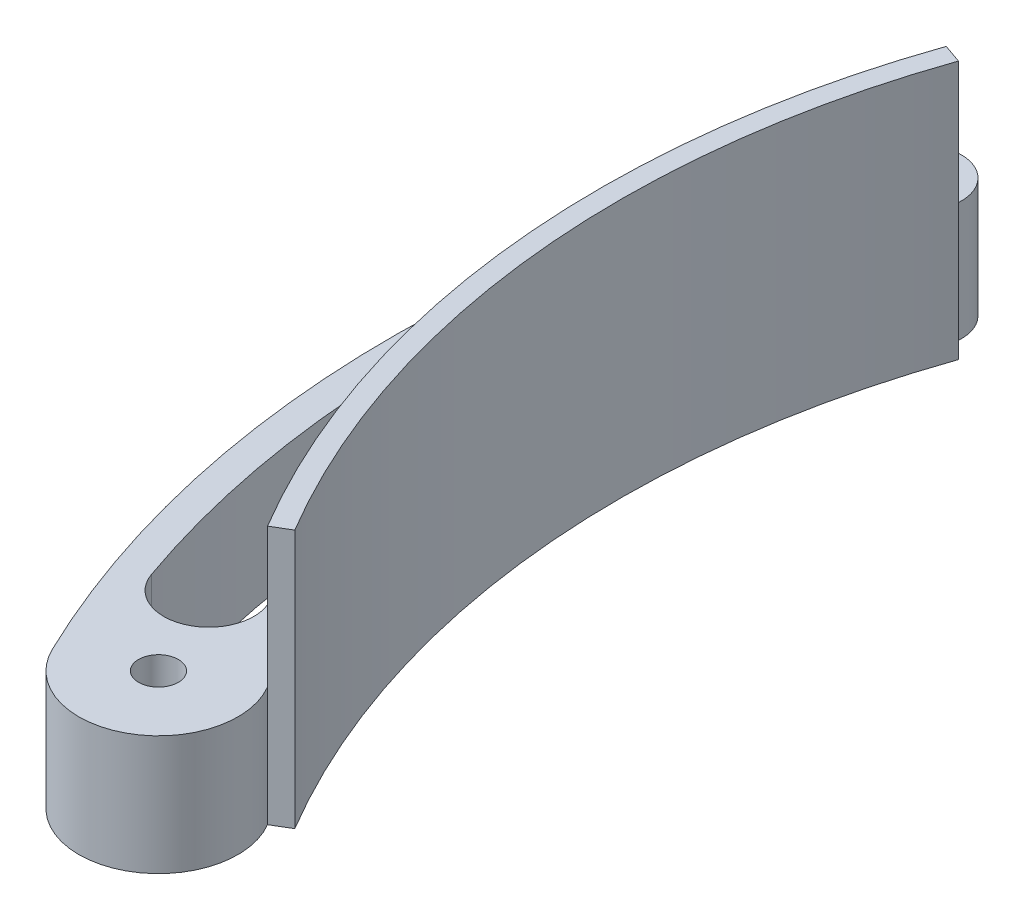
ISO-10303-21;
HEADER;
FILE_DESCRIPTION(('STEP AP214'),'2;1');
FILE_NAME('part.step','',(''),(''),'','','');
FILE_SCHEMA(('AUTOMOTIVE_DESIGN { 1 0 10303 214 1 1 1 1 }'));
ENDSEC;
DATA;
#1=APPLICATION_CONTEXT('core data for automotive mechanical design processes');
#2=APPLICATION_PROTOCOL_DEFINITION('international standard','automotive_design',2000,#1);
#3=PRODUCT_CONTEXT('',#1,'mechanical');
#4=PRODUCT('Part','Part','',(#3));
#5=PRODUCT_RELATED_PRODUCT_CATEGORY('part','',(#4));
#6=PRODUCT_DEFINITION_FORMATION('','',#4);
#7=PRODUCT_DEFINITION_CONTEXT('part definition',#1,'design');
#8=PRODUCT_DEFINITION('design','',#6,#7);
#9=PRODUCT_DEFINITION_SHAPE('','',#8);
#10=(LENGTH_UNIT() NAMED_UNIT(*) SI_UNIT(.MILLI.,.METRE.));
#11=(NAMED_UNIT(*) PLANE_ANGLE_UNIT() SI_UNIT($,.RADIAN.));
#12=(NAMED_UNIT(*) SI_UNIT($,.STERADIAN.) SOLID_ANGLE_UNIT());
#13=UNCERTAINTY_MEASURE_WITH_UNIT(LENGTH_MEASURE(1.E-05),#10,'distance_accuracy_value','');
#14=(GEOMETRIC_REPRESENTATION_CONTEXT(3) GLOBAL_UNCERTAINTY_ASSIGNED_CONTEXT((#13)) GLOBAL_UNIT_ASSIGNED_CONTEXT((#10,
#11,#12)) REPRESENTATION_CONTEXT('',''));
#15=CARTESIAN_POINT('',(0.,0.,0.));
#16=DIRECTION('',(0.,0.,1.));
#17=DIRECTION('',(1.,0.,0.));
#18=AXIS2_PLACEMENT_3D('',#15,#16,#17);
#19=CARTESIAN_POINT('',(0.,41.275,0.));
#20=DIRECTION('',(0.,-1.,0.));
#21=DIRECTION('',(0.,0.,-1.));
#22=AXIS2_PLACEMENT_3D('',#19,#20,#21);
#23=CYLINDRICAL_SURFACE('',#22,143.256);
#24=CARTESIAN_POINT('',(0.,0.,0.));
#25=DIRECTION('',(0.,1.,0.));
#26=DIRECTION('',(0.,0.,-1.));
#27=AXIS2_PLACEMENT_3D('',#24,#25,#26);
#28=CIRCLE('',#27,143.256);
#29=CARTESIAN_POINT('',(-135.252327307706,0.,-47.2132343082858));
#30=VERTEX_POINT('',#29);
#31=CARTESIAN_POINT('',(-123.105955958198,0.,73.2612117263843));
#32=VERTEX_POINT('',#31);
#33=EDGE_CURVE('E106',#30,#32,#28,.T.);
#34=ORIENTED_EDGE('',*,*,#33,.T.);
#35=DIRECTION('',(0.,-1.,0.));
#36=VECTOR('',#35,1.);
#37=CARTESIAN_POINT('',(-123.105955958198,41.275,73.2612117263843));
#38=LINE('',#37,#36);
#39=CARTESIAN_POINT('',(-123.105955958198,41.275,73.2612117263843));
#40=VERTEX_POINT('',#39);
#41=EDGE_CURVE('E12',#40,#32,#38,.T.);
#42=ORIENTED_EDGE('',*,*,#41,.F.);
#43=CARTESIAN_POINT('',(0.,41.275,0.));
#44=DIRECTION('',(0.,1.,0.));
#45=DIRECTION('',(0.,0.,-1.));
#46=AXIS2_PLACEMENT_3D('',#43,#44,#45);
#47=CIRCLE('',#46,143.256);
#48=CARTESIAN_POINT('',(-135.252327307706,41.275,-47.2132343082858));
#49=VERTEX_POINT('',#48);
#50=EDGE_CURVE('E94',#49,#40,#47,.T.);
#51=ORIENTED_EDGE('',*,*,#50,.F.);
#52=DIRECTION('',(0.,-1.,0.));
#53=VECTOR('',#52,1.);
#54=CARTESIAN_POINT('',(-135.252327307706,41.275,-47.2132343082858));
#55=LINE('',#54,#53);
#56=EDGE_CURVE('E102',#49,#30,#55,.T.);
#57=ORIENTED_EDGE('',*,*,#56,.T.);
#58=EDGE_LOOP('',(#34,#42,#51,#57));
#59=FACE_BOUND('',#58,.T.);
#60=ADVANCED_FACE('F43',(#59),#23,.T.);
#61=CARTESIAN_POINT('',(-123.105955958198,41.275,73.2612117263843));
#62=DIRECTION('',(-0.51140065146581,0.,-0.859342407705069));
#63=DIRECTION('',(-0.859342407705069,0.,0.51140065146581));
#64=AXIS2_PLACEMENT_3D('',#61,#62,#63);
#65=PLANE('',#64);
#66=DIRECTION('',(0.859342407705069,0.,-0.51140065146581));
#67=VECTOR('',#66,1.);
#68=CARTESIAN_POINT('',(-123.105955958198,0.,73.2612117263843));
#69=LINE('',#68,#67);
#70=CARTESIAN_POINT('',(-120.377543813735,0.,71.6375146579804));
#71=VERTEX_POINT('',#70);
#72=EDGE_CURVE('E98',#32,#71,#69,.T.);
#73=ORIENTED_EDGE('',*,*,#72,.T.);
#74=DIRECTION('',(0.,-1.,0.));
#75=VECTOR('',#74,1.);
#76=CARTESIAN_POINT('',(-120.377543813735,41.275,71.6375146579804));
#77=LINE('',#76,#75);
#78=CARTESIAN_POINT('',(-120.377543813735,41.275,71.6375146579804));
#79=VERTEX_POINT('',#78);
#80=EDGE_CURVE('E51',#79,#71,#77,.T.);
#81=ORIENTED_EDGE('',*,*,#80,.F.);
#82=DIRECTION('',(0.859342407705069,0.,-0.51140065146581));
#83=VECTOR('',#82,1.);
#84=CARTESIAN_POINT('',(-123.105955958198,41.275,73.2612117263843));
#85=LINE('',#84,#83);
#86=EDGE_CURVE('E89',#40,#79,#85,.T.);
#87=ORIENTED_EDGE('',*,*,#86,.F.);
#88=ORIENTED_EDGE('',*,*,#41,.T.);
#89=EDGE_LOOP('',(#73,#81,#87,#88));
#90=FACE_BOUND('',#89,.T.);
#91=ADVANCED_FACE('F97',(#90),#65,.F.);
#92=CARTESIAN_POINT('',(0.,41.275,0.));
#93=DIRECTION('',(0.,-1.,0.));
#94=DIRECTION('',(0.,0.,-1.));
#95=AXIS2_PLACEMENT_3D('',#92,#93,#94);
#96=CYLINDRICAL_SURFACE('',#95,140.081);
#97=CARTESIAN_POINT('',(0.,0.,0.));
#98=DIRECTION('',(0.,-1.,0.));
#99=DIRECTION('',(0.,0.,-1.));
#100=AXIS2_PLACEMENT_3D('',#97,#98,#99);
#101=CIRCLE('',#100,140.081);
#102=CARTESIAN_POINT('',(-132.254713670567,0.,-46.1668417039354));
#103=VERTEX_POINT('',#102);
#104=EDGE_CURVE('E76',#71,#103,#101,.T.);
#105=ORIENTED_EDGE('',*,*,#104,.T.);
#106=DIRECTION('',(0.,-1.,0.));
#107=VECTOR('',#106,1.);
#108=CARTESIAN_POINT('',(-132.254713670567,41.275,-46.1668417039354));
#109=LINE('',#108,#107);
#110=CARTESIAN_POINT('',(-132.254713670567,41.275,-46.1668417039354));
#111=VERTEX_POINT('',#110);
#112=EDGE_CURVE('E99',#111,#103,#109,.T.);
#113=ORIENTED_EDGE('',*,*,#112,.F.);
#114=CARTESIAN_POINT('',(0.,41.275,0.));
#115=DIRECTION('',(0.,-1.,0.));
#116=DIRECTION('',(0.,0.,-1.));
#117=AXIS2_PLACEMENT_3D('',#114,#115,#116);
#118=CIRCLE('',#117,140.081);
#119=EDGE_CURVE('E92',#79,#111,#118,.T.);
#120=ORIENTED_EDGE('',*,*,#119,.F.);
#121=ORIENTED_EDGE('',*,*,#80,.T.);
#122=EDGE_LOOP('',(#105,#113,#120,#121));
#123=FACE_BOUND('',#122,.T.);
#124=ADVANCED_FACE('F100',(#123),#96,.F.);
#125=CARTESIAN_POINT('',(-132.254713670567,41.275,-46.1668417039355));
#126=DIRECTION('',(-0.329572473811114,0.,0.944130279413823));
#127=DIRECTION('',(0.944130279413823,0.,0.329572473811114));
#128=AXIS2_PLACEMENT_3D('',#125,#126,#127);
#129=PLANE('',#128);
#130=DIRECTION('',(-0.944130279413823,0.,-0.329572473811114));
#131=VECTOR('',#130,1.);
#132=CARTESIAN_POINT('',(-132.254713670567,0.,-46.1668417039355));
#133=LINE('',#132,#131);
#134=EDGE_CURVE('E82',#103,#30,#133,.T.);
#135=ORIENTED_EDGE('',*,*,#134,.T.);
#136=ORIENTED_EDGE('',*,*,#56,.F.);
#137=DIRECTION('',(-0.944130279413823,0.,-0.329572473811114));
#138=VECTOR('',#137,1.);
#139=CARTESIAN_POINT('',(-132.254713670567,41.275,-46.1668417039355));
#140=LINE('',#139,#138);
#141=EDGE_CURVE('E59',#111,#49,#140,.T.);
#142=ORIENTED_EDGE('',*,*,#141,.F.);
#143=ORIENTED_EDGE('',*,*,#112,.T.);
#144=EDGE_LOOP('',(#135,#136,#142,#143));
#145=FACE_BOUND('',#144,.T.);
#146=ADVANCED_FACE('F113',(#145),#129,.F.);
#147=CARTESIAN_POINT('',(0.,41.275,0.));
#148=DIRECTION('',(0.,-1.,0.));
#149=DIRECTION('',(0.,0.,-1.));
#150=AXIS2_PLACEMENT_3D('',#147,#148,#149);
#151=PLANE('',#150);
#152=ORIENTED_EDGE('',*,*,#50,.T.);
#153=ORIENTED_EDGE('',*,*,#86,.T.);
#154=ORIENTED_EDGE('',*,*,#119,.T.);
#155=ORIENTED_EDGE('',*,*,#141,.T.);
#156=EDGE_LOOP('',(#152,#153,#154,#155));
#157=FACE_BOUND('',#156,.T.);
#158=ADVANCED_FACE('F90',(#157),#151,.F.);
#159=CARTESIAN_POINT('',(0.,0.,0.));
#160=DIRECTION('',(0.,-1.,0.));
#161=DIRECTION('',(0.,0.,-1.));
#162=AXIS2_PLACEMENT_3D('',#159,#160,#161);
#163=PLANE('',#162);
#164=ORIENTED_EDGE('',*,*,#33,.F.);
#165=ORIENTED_EDGE('',*,*,#134,.F.);
#166=ORIENTED_EDGE('',*,*,#104,.F.);
#167=ORIENTED_EDGE('',*,*,#72,.F.);
#168=EDGE_LOOP('',(#164,#165,#166,#167));
#169=FACE_BOUND('',#168,.T.);
#170=ADVANCED_FACE('F116',(#169),#163,.T.);
#171=CLOSED_SHELL('',(#60,#91,#124,#146,#158,#170));
#172=MANIFOLD_SOLID_BREP('B2',#171);
#173=CARTESIAN_POINT('',(-70.623777290992,19.05,-24.6530097584931));
#174=DIRECTION('',(0.,-1.,0.));
#175=DIRECTION('',(0.,0.,-1.));
#176=AXIS2_PLACEMENT_3D('',#173,#174,#175);
#177=PLANE('',#176);
#178=CARTESIAN_POINT('',(6.10622663543836E-13,19.05,14.9965934754486));
#179=DIRECTION('',(0.,1.,0.));
#180=DIRECTION('',(0.,0.,1.));
#181=AXIS2_PLACEMENT_3D('',#178,#179,#180);
#182=CIRCLE('',#181,156.783175561678);
#183=CARTESIAN_POINT('',(-156.687530970008,19.05,20.4721553394356));
#184=VERTEX_POINT('',#183);
#185=CARTESIAN_POINT('',(-147.905040723107,19.05,67.0068142777081));
#186=VERTEX_POINT('',#185);
#187=EDGE_CURVE('E283',#184,#186,#182,.T.);
#188=ORIENTED_EDGE('',*,*,#187,.F.);
#189=CARTESIAN_POINT('',(-151.678534298402,19.05,20.2971122394384));
#190=DIRECTION('',(0.,1.,0.));
#191=DIRECTION('',(0.,0.,-1.));
#192=AXIS2_PLACEMENT_3D('',#189,#190,#191);
#193=CIRCLE('',#192,5.01205424382321);
#194=CARTESIAN_POINT('',(-146.710761390019,19.05,19.6323415468161));
#195=VERTEX_POINT('',#194);
#196=EDGE_CURVE('E182',#195,#184,#193,.T.);
#197=ORIENTED_EDGE('',*,*,#196,.F.);
#198=CARTESIAN_POINT('',(0.,19.05,0.));
#199=DIRECTION('',(0.,-1.,0.));
#200=DIRECTION('',(0.,0.,1.));
#201=AXIS2_PLACEMENT_3D('',#198,#199,#200);
#202=CIRCLE('',#201,148.0185);
#203=CARTESIAN_POINT('',(-134.579739329338,19.05,61.6260505330135));
#204=VERTEX_POINT('',#203);
#205=EDGE_CURVE('E274',#204,#195,#202,.T.);
#206=ORIENTED_EDGE('',*,*,#205,.F.);
#207=CARTESIAN_POINT('',(-141.119521250419,19.05,64.6207132746109));
#208=DIRECTION('',(0.,1.,0.));
#209=DIRECTION('',(0.,0.,1.));
#210=AXIS2_PLACEMENT_3D('',#207,#208,#209);
#211=CIRCLE('',#210,7.19282646191412);
#212=EDGE_CURVE('E277',#186,#204,#211,.T.);
#213=ORIENTED_EDGE('',*,*,#212,.F.);
#214=EDGE_LOOP('',(#188,#197,#206,#213));
#215=FACE_BOUND('',#214,.T.);
#216=CARTESIAN_POINT('',(-141.247554581984,19.05,-49.3060195169863));
#217=DIRECTION('',(0.,1.,0.));
#218=DIRECTION('',(0.,0.,-1.));
#219=AXIS2_PLACEMENT_3D('',#216,#217,#218);
#220=CIRCLE('',#219,2.38125000000001);
#221=CARTESIAN_POINT('',(-138.99934435413,19.05,-48.5212250637236));
#222=VERTEX_POINT('',#221);
#223=CARTESIAN_POINT('',(-143.414791124697,19.05,-50.2926487940848));
#224=VERTEX_POINT('',#223);
#225=EDGE_CURVE('E308',#222,#224,#220,.T.);
#226=ORIENTED_EDGE('',*,*,#225,.F.);
#227=CARTESIAN_POINT('',(0.,19.05,0.));
#228=DIRECTION('',(0.,-1.,0.));
#229=DIRECTION('',(0.,0.,1.));
#230=AXIS2_PLACEMENT_3D('',#227,#228,#229);
#231=CIRCLE('',#230,147.22475);
#232=CARTESIAN_POINT('',(-147.012407174969,19.05,-7.9043753190894));
#233=VERTEX_POINT('',#232);
#234=EDGE_CURVE('E289',#233,#222,#231,.T.);
#235=ORIENTED_EDGE('',*,*,#234,.F.);
#236=CARTESIAN_POINT('',(-151.412669682045,19.05,-8.1409630127869));
#237=DIRECTION('',(0.,1.,0.));
#238=DIRECTION('',(0.,0.,-1.));
#239=AXIS2_PLACEMENT_3D('',#236,#237,#238);
#240=CIRCLE('',#239,4.40661818949472);
#241=CARTESIAN_POINT('',(-155.768721685777,19.05,-8.80661668307543));
#242=VERTEX_POINT('',#241);
#243=EDGE_CURVE('E297',#242,#233,#240,.T.);
#244=ORIENTED_EDGE('',*,*,#243,.F.);
#245=CARTESIAN_POINT('',(6.10622663543836E-13,19.05,14.9965934754486));
#246=DIRECTION('',(0.,1.,0.));
#247=DIRECTION('',(0.,0.,1.));
#248=AXIS2_PLACEMENT_3D('',#245,#246,#247);
#249=CIRCLE('',#248,157.576925561678);
#250=EDGE_CURVE('E311',#224,#242,#249,.T.);
#251=ORIENTED_EDGE('',*,*,#250,.F.);
#252=EDGE_LOOP('',(#226,#235,#244,#251));
#253=FACE_BOUND('',#252,.T.);
#254=CARTESIAN_POINT('',(-141.247554581984,19.05,-49.3060195169863));
#255=DIRECTION('',(0.,1.,0.));
#256=DIRECTION('',(0.,0.,-1.));
#257=AXIS2_PLACEMENT_3D('',#254,#255,#256);
#258=CIRCLE('',#257,6.34999999999998);
#259=CARTESIAN_POINT('',(-135.252327307706,19.05,-47.2132343082858));
#260=VERTEX_POINT('',#259);
#261=CARTESIAN_POINT('',(-147.02685202922,19.05,-51.9370309225823));
#262=VERTEX_POINT('',#261);
#263=EDGE_CURVE('E337',#260,#262,#258,.T.);
#264=ORIENTED_EDGE('',*,*,#263,.T.);
#265=CARTESIAN_POINT('',(6.10622663543836E-13,19.05,14.9965934754486));
#266=DIRECTION('',(0.,1.,0.));
#267=DIRECTION('',(0.,0.,-1.));
#268=AXIS2_PLACEMENT_3D('',#265,#266,#267);
#269=CIRCLE('',#268,161.545675561678);
#270=CARTESIAN_POINT('',(-145.454595651415,19.05,85.2814844304899));
#271=VERTEX_POINT('',#270);
#272=EDGE_CURVE('E340',#262,#271,#269,.T.);
#273=ORIENTED_EDGE('',*,*,#272,.T.);
#274=CARTESIAN_POINT('',(-134.019604536053,19.05,79.756));
#275=DIRECTION('',(0.,1.,0.));
#276=DIRECTION('',(0.,0.,-1.));
#277=AXIS2_PLACEMENT_3D('',#274,#275,#276);
#278=CIRCLE('',#277,12.7);
#279=CARTESIAN_POINT('',(-123.105955958198,19.05,73.2612117263844));
#280=VERTEX_POINT('',#279);
#281=EDGE_CURVE('E343',#271,#280,#278,.T.);
#282=ORIENTED_EDGE('',*,*,#281,.T.);
#283=CARTESIAN_POINT('',(0.,19.05,0.));
#284=DIRECTION('',(0.,-1.,0.));
#285=DIRECTION('',(0.,0.,1.));
#286=AXIS2_PLACEMENT_3D('',#283,#284,#285);
#287=CIRCLE('',#286,143.256);
#288=EDGE_CURVE('E345',#280,#260,#287,.T.);
#289=ORIENTED_EDGE('',*,*,#288,.T.);
#290=EDGE_LOOP('',(#264,#273,#282,#289));
#291=FACE_BOUND('',#290,.T.);
#292=CARTESIAN_POINT('',(-134.019604536053,19.05,79.756));
#293=DIRECTION('',(0.,1.,0.));
#294=DIRECTION('',(0.,0.,1.));
#295=AXIS2_PLACEMENT_3D('',#292,#293,#294);
#296=CIRCLE('',#295,3.17499999999997);
#297=CARTESIAN_POINT('',(-134.019604536053,19.05,82.931));
#298=VERTEX_POINT('',#297);
#299=EDGE_CURVE('E331',#298,#298,#296,.T.);
#300=ORIENTED_EDGE('',*,*,#299,.F.);
#301=EDGE_LOOP('',(#300));
#302=FACE_BOUND('',#301,.T.);
#303=CARTESIAN_POINT('',(-152.238831544355,19.05,5.76613740234445));
#304=DIRECTION('',(0.,1.,0.));
#305=DIRECTION('',(0.,0.,1.));
#306=AXIS2_PLACEMENT_3D('',#303,#304,#305);
#307=CIRCLE('',#306,3.175);
#308=CARTESIAN_POINT('',(-152.238831544355,19.05,8.94113740234445));
#309=VERTEX_POINT('',#308);
#310=EDGE_CURVE('E325',#309,#309,#307,.T.);
#311=ORIENTED_EDGE('',*,*,#310,.F.);
#312=EDGE_LOOP('',(#311));
#313=FACE_BOUND('',#312,.T.);
#314=ADVANCED_FACE('F167',(#215,#253,#291,#302,#313),#177,.F.);
#315=CARTESIAN_POINT('',(-70.623777290992,0.,-24.6530097584931));
#316=DIRECTION('',(0.,-1.,0.));
#317=DIRECTION('',(0.,0.,-1.));
#318=AXIS2_PLACEMENT_3D('',#315,#316,#317);
#319=PLANE('',#318);
#320=CARTESIAN_POINT('',(-151.678534298402,0.,20.2971122394384));
#321=DIRECTION('',(0.,1.,0.));
#322=DIRECTION('',(0.,0.,-1.));
#323=AXIS2_PLACEMENT_3D('',#320,#321,#322);
#324=CIRCLE('',#323,5.01205424382321);
#325=CARTESIAN_POINT('',(-146.710761390019,0.,19.6323415468161));
#326=VERTEX_POINT('',#325);
#327=CARTESIAN_POINT('',(-156.687530970008,0.,20.4721553394356));
#328=VERTEX_POINT('',#327);
#329=EDGE_CURVE('E258',#326,#328,#324,.T.);
#330=ORIENTED_EDGE('',*,*,#329,.T.);
#331=CARTESIAN_POINT('',(6.10622663543836E-13,0.,14.9965934754486));
#332=DIRECTION('',(0.,1.,0.));
#333=DIRECTION('',(0.,0.,1.));
#334=AXIS2_PLACEMENT_3D('',#331,#332,#333);
#335=CIRCLE('',#334,156.783175561678);
#336=CARTESIAN_POINT('',(-147.905040723107,0.,67.0068142777081));
#337=VERTEX_POINT('',#336);
#338=EDGE_CURVE('E267',#328,#337,#335,.T.);
#339=ORIENTED_EDGE('',*,*,#338,.T.);
#340=CARTESIAN_POINT('',(-141.119521250419,0.,64.6207132746109));
#341=DIRECTION('',(0.,1.,0.));
#342=DIRECTION('',(0.,0.,1.));
#343=AXIS2_PLACEMENT_3D('',#340,#341,#342);
#344=CIRCLE('',#343,7.19282646191412);
#345=CARTESIAN_POINT('',(-134.579739329338,0.,61.6260505330135));
#346=VERTEX_POINT('',#345);
#347=EDGE_CURVE('E190',#337,#346,#344,.T.);
#348=ORIENTED_EDGE('',*,*,#347,.T.);
#349=CARTESIAN_POINT('',(0.,0.,0.));
#350=DIRECTION('',(0.,-1.,0.));
#351=DIRECTION('',(0.,0.,1.));
#352=AXIS2_PLACEMENT_3D('',#349,#350,#351);
#353=CIRCLE('',#352,148.0185);
#354=EDGE_CURVE('E264',#346,#326,#353,.T.);
#355=ORIENTED_EDGE('',*,*,#354,.T.);
#356=EDGE_LOOP('',(#330,#339,#348,#355));
#357=FACE_BOUND('',#356,.T.);
#358=CARTESIAN_POINT('',(0.,0.,0.));
#359=DIRECTION('',(0.,-1.,0.));
#360=DIRECTION('',(0.,0.,1.));
#361=AXIS2_PLACEMENT_3D('',#358,#359,#360);
#362=CIRCLE('',#361,147.22475);
#363=CARTESIAN_POINT('',(-147.012407174969,0.,-7.9043753190894));
#364=VERTEX_POINT('',#363);
#365=CARTESIAN_POINT('',(-138.99934435413,0.,-48.5212250637236));
#366=VERTEX_POINT('',#365);
#367=EDGE_CURVE('E293',#364,#366,#362,.T.);
#368=ORIENTED_EDGE('',*,*,#367,.T.);
#369=CARTESIAN_POINT('',(-141.247554581984,0.,-49.3060195169863));
#370=DIRECTION('',(0.,1.,0.));
#371=DIRECTION('',(0.,0.,-1.));
#372=AXIS2_PLACEMENT_3D('',#369,#370,#371);
#373=CIRCLE('',#372,2.38125000000001);
#374=CARTESIAN_POINT('',(-143.414791124697,0.,-50.2926487940848));
#375=VERTEX_POINT('',#374);
#376=EDGE_CURVE('E296',#366,#375,#373,.T.);
#377=ORIENTED_EDGE('',*,*,#376,.T.);
#378=CARTESIAN_POINT('',(6.10622663543836E-13,0.,14.9965934754486));
#379=DIRECTION('',(0.,1.,0.));
#380=DIRECTION('',(0.,0.,1.));
#381=AXIS2_PLACEMENT_3D('',#378,#379,#380);
#382=CIRCLE('',#381,157.576925561678);
#383=CARTESIAN_POINT('',(-155.768721685777,0.,-8.80661668307543));
#384=VERTEX_POINT('',#383);
#385=EDGE_CURVE('E300',#375,#384,#382,.T.);
#386=ORIENTED_EDGE('',*,*,#385,.T.);
#387=CARTESIAN_POINT('',(-151.412669682045,0.,-8.1409630127869));
#388=DIRECTION('',(0.,1.,0.));
#389=DIRECTION('',(0.,0.,-1.));
#390=AXIS2_PLACEMENT_3D('',#387,#388,#389);
#391=CIRCLE('',#390,4.40661818949472);
#392=EDGE_CURVE('E303',#384,#364,#391,.T.);
#393=ORIENTED_EDGE('',*,*,#392,.T.);
#394=EDGE_LOOP('',(#368,#377,#386,#393));
#395=FACE_BOUND('',#394,.T.);
#396=CARTESIAN_POINT('',(-134.019604536053,0.,79.756));
#397=DIRECTION('',(0.,1.,0.));
#398=DIRECTION('',(0.,0.,1.));
#399=AXIS2_PLACEMENT_3D('',#396,#397,#398);
#400=CIRCLE('',#399,3.17499999999997);
#401=CARTESIAN_POINT('',(-134.019604536053,0.,82.931));
#402=VERTEX_POINT('',#401);
#403=EDGE_CURVE('E328',#402,#402,#400,.T.);
#404=ORIENTED_EDGE('',*,*,#403,.T.);
#405=EDGE_LOOP('',(#404));
#406=FACE_BOUND('',#405,.T.);
#407=CARTESIAN_POINT('',(-141.247554581984,0.,-49.3060195169863));
#408=DIRECTION('',(0.,1.,0.));
#409=DIRECTION('',(0.,0.,-1.));
#410=AXIS2_PLACEMENT_3D('',#407,#408,#409);
#411=CIRCLE('',#410,6.34999999999998);
#412=CARTESIAN_POINT('',(-135.252327307706,0.,-47.2132343082858));
#413=VERTEX_POINT('',#412);
#414=CARTESIAN_POINT('',(-147.02685202922,0.,-51.9370309225823));
#415=VERTEX_POINT('',#414);
#416=EDGE_CURVE('E334',#413,#415,#411,.T.);
#417=ORIENTED_EDGE('',*,*,#416,.F.);
#418=CARTESIAN_POINT('',(0.,0.,0.));
#419=DIRECTION('',(0.,-1.,0.));
#420=DIRECTION('',(0.,0.,1.));
#421=AXIS2_PLACEMENT_3D('',#418,#419,#420);
#422=CIRCLE('',#421,143.256);
#423=CARTESIAN_POINT('',(-123.105955958198,0.,73.2612117263844));
#424=VERTEX_POINT('',#423);
#425=EDGE_CURVE('E341',#424,#413,#422,.T.);
#426=ORIENTED_EDGE('',*,*,#425,.F.);
#427=CARTESIAN_POINT('',(-134.019604536053,0.,79.756));
#428=DIRECTION('',(0.,1.,0.));
#429=DIRECTION('',(0.,0.,-1.));
#430=AXIS2_PLACEMENT_3D('',#427,#428,#429);
#431=CIRCLE('',#430,12.7);
#432=CARTESIAN_POINT('',(-145.454595651415,0.,85.2814844304899));
#433=VERTEX_POINT('',#432);
#434=EDGE_CURVE('E352',#433,#424,#431,.T.);
#435=ORIENTED_EDGE('',*,*,#434,.F.);
#436=CARTESIAN_POINT('',(6.10622663543836E-13,0.,14.9965934754486));
#437=DIRECTION('',(0.,1.,0.));
#438=DIRECTION('',(0.,0.,-1.));
#439=AXIS2_PLACEMENT_3D('',#436,#437,#438);
#440=CIRCLE('',#439,161.545675561678);
#441=EDGE_CURVE('E350',#415,#433,#440,.T.);
#442=ORIENTED_EDGE('',*,*,#441,.F.);
#443=EDGE_LOOP('',(#417,#426,#435,#442));
#444=FACE_BOUND('',#443,.T.);
#445=CARTESIAN_POINT('',(-152.238831544355,0.,5.76613740234445));
#446=DIRECTION('',(0.,1.,0.));
#447=DIRECTION('',(0.,0.,1.));
#448=AXIS2_PLACEMENT_3D('',#445,#446,#447);
#449=CIRCLE('',#448,3.175);
#450=CARTESIAN_POINT('',(-152.238831544355,0.,8.94113740234445));
#451=VERTEX_POINT('',#450);
#452=EDGE_CURVE('E318',#451,#451,#449,.T.);
#453=ORIENTED_EDGE('',*,*,#452,.T.);
#454=EDGE_LOOP('',(#453));
#455=FACE_BOUND('',#454,.T.);
#456=ADVANCED_FACE('F271',(#357,#395,#406,#444,#455),#319,.T.);
#457=CARTESIAN_POINT('',(-141.247554581984,19.05,-49.3060195169863));
#458=DIRECTION('',(0.,-1.,0.));
#459=DIRECTION('',(0.,0.,-1.));
#460=AXIS2_PLACEMENT_3D('',#457,#458,#459);
#461=CYLINDRICAL_SURFACE('',#460,6.34999999999998);
#462=ORIENTED_EDGE('',*,*,#416,.T.);
#463=DIRECTION('',(0.,-1.,0.));
#464=VECTOR('',#463,1.);
#465=CARTESIAN_POINT('',(-147.02685202922,19.05,-51.9370309225823));
#466=LINE('',#465,#464);
#467=EDGE_CURVE('E41',#262,#415,#466,.T.);
#468=ORIENTED_EDGE('',*,*,#467,.F.);
#469=ORIENTED_EDGE('',*,*,#263,.F.);
#470=DIRECTION('',(0.,-1.,0.));
#471=VECTOR('',#470,1.);
#472=CARTESIAN_POINT('',(-135.252327307706,19.05,-47.2132343082858));
#473=LINE('',#472,#471);
#474=EDGE_CURVE('E347',#260,#413,#473,.T.);
#475=ORIENTED_EDGE('',*,*,#474,.T.);
#476=EDGE_LOOP('',(#462,#468,#469,#475));
#477=FACE_BOUND('',#476,.T.);
#478=ADVANCED_FACE('F169',(#477),#461,.T.);
#479=CARTESIAN_POINT('',(6.10622663543836E-13,19.05,14.9965934754486));
#480=DIRECTION('',(0.,-1.,0.));
#481=DIRECTION('',(0.,0.,-1.));
#482=AXIS2_PLACEMENT_3D('',#479,#480,#481);
#483=CYLINDRICAL_SURFACE('',#482,161.545675561678);
#484=ORIENTED_EDGE('',*,*,#441,.T.);
#485=DIRECTION('',(0.,-1.,0.));
#486=VECTOR('',#485,1.);
#487=CARTESIAN_POINT('',(-145.454595651415,19.05,85.2814844304899));
#488=LINE('',#487,#486);
#489=EDGE_CURVE('E175',#271,#433,#488,.T.);
#490=ORIENTED_EDGE('',*,*,#489,.F.);
#491=ORIENTED_EDGE('',*,*,#272,.F.);
#492=ORIENTED_EDGE('',*,*,#467,.T.);
#493=EDGE_LOOP('',(#484,#490,#491,#492));
#494=FACE_BOUND('',#493,.T.);
#495=ADVANCED_FACE('F380',(#494),#483,.T.);
#496=CARTESIAN_POINT('',(-134.019604536053,19.05,79.756));
#497=DIRECTION('',(0.,-1.,0.));
#498=DIRECTION('',(0.,0.,-1.));
#499=AXIS2_PLACEMENT_3D('',#496,#497,#498);
#500=CYLINDRICAL_SURFACE('',#499,12.7);
#501=ORIENTED_EDGE('',*,*,#434,.T.);
#502=DIRECTION('',(0.,-1.,0.));
#503=VECTOR('',#502,1.);
#504=CARTESIAN_POINT('',(-123.105955958198,19.05,73.2612117263844));
#505=LINE('',#504,#503);
#506=EDGE_CURVE('E357',#280,#424,#505,.T.);
#507=ORIENTED_EDGE('',*,*,#506,.F.);
#508=ORIENTED_EDGE('',*,*,#281,.F.);
#509=ORIENTED_EDGE('',*,*,#489,.T.);
#510=EDGE_LOOP('',(#501,#507,#508,#509));
#511=FACE_BOUND('',#510,.T.);
#512=ADVANCED_FACE('F364',(#511),#500,.T.);
#513=CARTESIAN_POINT('',(0.,19.05,0.));
#514=DIRECTION('',(0.,-1.,0.));
#515=DIRECTION('',(0.,0.,-1.));
#516=AXIS2_PLACEMENT_3D('',#513,#514,#515);
#517=CYLINDRICAL_SURFACE('',#516,143.256);
#518=ORIENTED_EDGE('',*,*,#425,.T.);
#519=ORIENTED_EDGE('',*,*,#474,.F.);
#520=ORIENTED_EDGE('',*,*,#288,.F.);
#521=ORIENTED_EDGE('',*,*,#506,.T.);
#522=EDGE_LOOP('',(#518,#519,#520,#521));
#523=FACE_BOUND('',#522,.T.);
#524=ADVANCED_FACE('F373',(#523),#517,.F.);
#525=CARTESIAN_POINT('',(-134.019604536053,19.05,79.756));
#526=DIRECTION('',(0.,-1.,0.));
#527=DIRECTION('',(0.,0.,-1.));
#528=AXIS2_PLACEMENT_3D('',#525,#526,#527);
#529=CYLINDRICAL_SURFACE('',#528,3.17499999999997);
#530=ORIENTED_EDGE('',*,*,#299,.T.);
#531=EDGE_LOOP('',(#530));
#532=FACE_BOUND('',#531,.T.);
#533=ORIENTED_EDGE('',*,*,#403,.F.);
#534=EDGE_LOOP('',(#533));
#535=FACE_BOUND('',#534,.T.);
#536=ADVANCED_FACE('F396',(#532,#535),#529,.F.);
#537=CARTESIAN_POINT('',(-152.238831544355,19.05,5.76613740234445));
#538=DIRECTION('',(0.,-1.,0.));
#539=DIRECTION('',(0.,0.,-1.));
#540=AXIS2_PLACEMENT_3D('',#537,#538,#539);
#541=CYLINDRICAL_SURFACE('',#540,3.175);
#542=ORIENTED_EDGE('',*,*,#310,.T.);
#543=EDGE_LOOP('',(#542));
#544=FACE_BOUND('',#543,.T.);
#545=ORIENTED_EDGE('',*,*,#452,.F.);
#546=EDGE_LOOP('',(#545));
#547=FACE_BOUND('',#546,.T.);
#548=ADVANCED_FACE('F403',(#544,#547),#541,.F.);
#549=CARTESIAN_POINT('',(0.,0.,0.));
#550=DIRECTION('',(0.,1.,0.));
#551=DIRECTION('',(0.,0.,1.));
#552=AXIS2_PLACEMENT_3D('',#549,#550,#551);
#553=CYLINDRICAL_SURFACE('',#552,147.22475);
#554=ORIENTED_EDGE('',*,*,#234,.T.);
#555=DIRECTION('',(0.,1.,0.));
#556=VECTOR('',#555,1.);
#557=CARTESIAN_POINT('',(-138.99934435413,0.,-48.5212250637236));
#558=LINE('',#557,#556);
#559=EDGE_CURVE('E306',#366,#222,#558,.T.);
#560=ORIENTED_EDGE('',*,*,#559,.F.);
#561=ORIENTED_EDGE('',*,*,#367,.F.);
#562=DIRECTION('',(0.,1.,0.));
#563=VECTOR('',#562,1.);
#564=CARTESIAN_POINT('',(-147.012407174969,0.,-7.9043753190894));
#565=LINE('',#564,#563);
#566=EDGE_CURVE('E316',#364,#233,#565,.T.);
#567=ORIENTED_EDGE('',*,*,#566,.T.);
#568=EDGE_LOOP('',(#554,#560,#561,#567));
#569=FACE_BOUND('',#568,.T.);
#570=ADVANCED_FACE('F408',(#569),#553,.T.);
#571=CARTESIAN_POINT('',(-151.412669682045,0.,-8.1409630127869));
#572=DIRECTION('',(0.,1.,0.));
#573=DIRECTION('',(0.,0.,1.));
#574=AXIS2_PLACEMENT_3D('',#571,#572,#573);
#575=CYLINDRICAL_SURFACE('',#574,4.40661818949472);
#576=ORIENTED_EDGE('',*,*,#243,.T.);
#577=ORIENTED_EDGE('',*,*,#566,.F.);
#578=ORIENTED_EDGE('',*,*,#392,.F.);
#579=DIRECTION('',(0.,1.,0.));
#580=VECTOR('',#579,1.);
#581=CARTESIAN_POINT('',(-155.768721685777,0.,-8.80661668307543));
#582=LINE('',#581,#580);
#583=EDGE_CURVE('E319',#384,#242,#582,.T.);
#584=ORIENTED_EDGE('',*,*,#583,.T.);
#585=EDGE_LOOP('',(#576,#577,#578,#584));
#586=FACE_BOUND('',#585,.T.);
#587=ADVANCED_FACE('F421',(#586),#575,.F.);
#588=CARTESIAN_POINT('',(6.10622663543836E-13,0.,14.9965934754486));
#589=DIRECTION('',(0.,1.,0.));
#590=DIRECTION('',(0.,0.,1.));
#591=AXIS2_PLACEMENT_3D('',#588,#589,#590);
#592=CYLINDRICAL_SURFACE('',#591,157.576925561678);
#593=ORIENTED_EDGE('',*,*,#250,.T.);
#594=ORIENTED_EDGE('',*,*,#583,.F.);
#595=ORIENTED_EDGE('',*,*,#385,.F.);
#596=DIRECTION('',(0.,1.,0.));
#597=VECTOR('',#596,1.);
#598=CARTESIAN_POINT('',(-143.414791124697,0.,-50.2926487940848));
#599=LINE('',#598,#597);
#600=EDGE_CURVE('E321',#375,#224,#599,.T.);
#601=ORIENTED_EDGE('',*,*,#600,.T.);
#602=EDGE_LOOP('',(#593,#594,#595,#601));
#603=FACE_BOUND('',#602,.T.);
#604=ADVANCED_FACE('F428',(#603),#592,.F.);
#605=CARTESIAN_POINT('',(-141.247554581984,0.,-49.3060195169863));
#606=DIRECTION('',(0.,1.,0.));
#607=DIRECTION('',(0.,0.,1.));
#608=AXIS2_PLACEMENT_3D('',#605,#606,#607);
#609=CYLINDRICAL_SURFACE('',#608,2.38125000000001);
#610=ORIENTED_EDGE('',*,*,#225,.T.);
#611=ORIENTED_EDGE('',*,*,#600,.F.);
#612=ORIENTED_EDGE('',*,*,#376,.F.);
#613=ORIENTED_EDGE('',*,*,#559,.T.);
#614=EDGE_LOOP('',(#610,#611,#612,#613));
#615=FACE_BOUND('',#614,.T.);
#616=ADVANCED_FACE('F425',(#615),#609,.F.);
#617=CARTESIAN_POINT('',(-151.678534298402,0.,20.2971122394384));
#618=DIRECTION('',(0.,1.,0.));
#619=DIRECTION('',(0.,0.,1.));
#620=AXIS2_PLACEMENT_3D('',#617,#618,#619);
#621=CYLINDRICAL_SURFACE('',#620,5.01205424382321);
#622=ORIENTED_EDGE('',*,*,#196,.T.);
#623=DIRECTION('',(0.,1.,0.));
#624=VECTOR('',#623,1.);
#625=CARTESIAN_POINT('',(-156.687530970008,0.,20.4721553394356));
#626=LINE('',#625,#624);
#627=EDGE_CURVE('E254',#328,#184,#626,.T.);
#628=ORIENTED_EDGE('',*,*,#627,.F.);
#629=ORIENTED_EDGE('',*,*,#329,.F.);
#630=DIRECTION('',(0.,1.,0.));
#631=VECTOR('',#630,1.);
#632=CARTESIAN_POINT('',(-146.710761390019,0.,19.6323415468161));
#633=LINE('',#632,#631);
#634=EDGE_CURVE('E287',#326,#195,#633,.T.);
#635=ORIENTED_EDGE('',*,*,#634,.T.);
#636=EDGE_LOOP('',(#622,#628,#629,#635));
#637=FACE_BOUND('',#636,.T.);
#638=ADVANCED_FACE('F256',(#637),#621,.F.);
#639=CARTESIAN_POINT('',(0.,0.,0.));
#640=DIRECTION('',(0.,1.,0.));
#641=DIRECTION('',(0.,0.,1.));
#642=AXIS2_PLACEMENT_3D('',#639,#640,#641);
#643=CYLINDRICAL_SURFACE('',#642,148.0185);
#644=ORIENTED_EDGE('',*,*,#205,.T.);
#645=ORIENTED_EDGE('',*,*,#634,.F.);
#646=ORIENTED_EDGE('',*,*,#354,.F.);
#647=DIRECTION('',(0.,1.,0.));
#648=VECTOR('',#647,1.);
#649=CARTESIAN_POINT('',(-134.579739329338,0.,61.6260505330135));
#650=LINE('',#649,#648);
#651=EDGE_CURVE('E290',#346,#204,#650,.T.);
#652=ORIENTED_EDGE('',*,*,#651,.T.);
#653=EDGE_LOOP('',(#644,#645,#646,#652));
#654=FACE_BOUND('',#653,.T.);
#655=ADVANCED_FACE('F438',(#654),#643,.T.);
#656=CARTESIAN_POINT('',(-141.119521250419,0.,64.6207132746109));
#657=DIRECTION('',(0.,1.,0.));
#658=DIRECTION('',(0.,0.,1.));
#659=AXIS2_PLACEMENT_3D('',#656,#657,#658);
#660=CYLINDRICAL_SURFACE('',#659,7.19282646191412);
#661=ORIENTED_EDGE('',*,*,#212,.T.);
#662=ORIENTED_EDGE('',*,*,#651,.F.);
#663=ORIENTED_EDGE('',*,*,#347,.F.);
#664=DIRECTION('',(0.,1.,0.));
#665=VECTOR('',#664,1.);
#666=CARTESIAN_POINT('',(-147.905040723107,0.,67.0068142777081));
#667=LINE('',#666,#665);
#668=EDGE_CURVE('E263',#337,#186,#667,.T.);
#669=ORIENTED_EDGE('',*,*,#668,.T.);
#670=EDGE_LOOP('',(#661,#662,#663,#669));
#671=FACE_BOUND('',#670,.T.);
#672=ADVANCED_FACE('F441',(#671),#660,.F.);
#673=CARTESIAN_POINT('',(6.10622663543836E-13,0.,14.9965934754486));
#674=DIRECTION('',(0.,1.,0.));
#675=DIRECTION('',(0.,0.,1.));
#676=AXIS2_PLACEMENT_3D('',#673,#674,#675);
#677=CYLINDRICAL_SURFACE('',#676,156.783175561678);
#678=ORIENTED_EDGE('',*,*,#187,.T.);
#679=ORIENTED_EDGE('',*,*,#668,.F.);
#680=ORIENTED_EDGE('',*,*,#338,.F.);
#681=ORIENTED_EDGE('',*,*,#627,.T.);
#682=EDGE_LOOP('',(#678,#679,#680,#681));
#683=FACE_BOUND('',#682,.T.);
#684=ADVANCED_FACE('F268',(#683),#677,.F.);
#685=CLOSED_SHELL('',(#314,#456,#478,#495,#512,#524,#536,#548,#570,#587,#604,#616,#638,#655,
#672,#684));
#686=MANIFOLD_SOLID_BREP('B6',#685);
#687=ADVANCED_BREP_SHAPE_REPRESENTATION('',(#18,#172,#686),#14);
#688=SHAPE_DEFINITION_REPRESENTATION(#9,#687);
ENDSEC;
END-ISO-10303-21;
